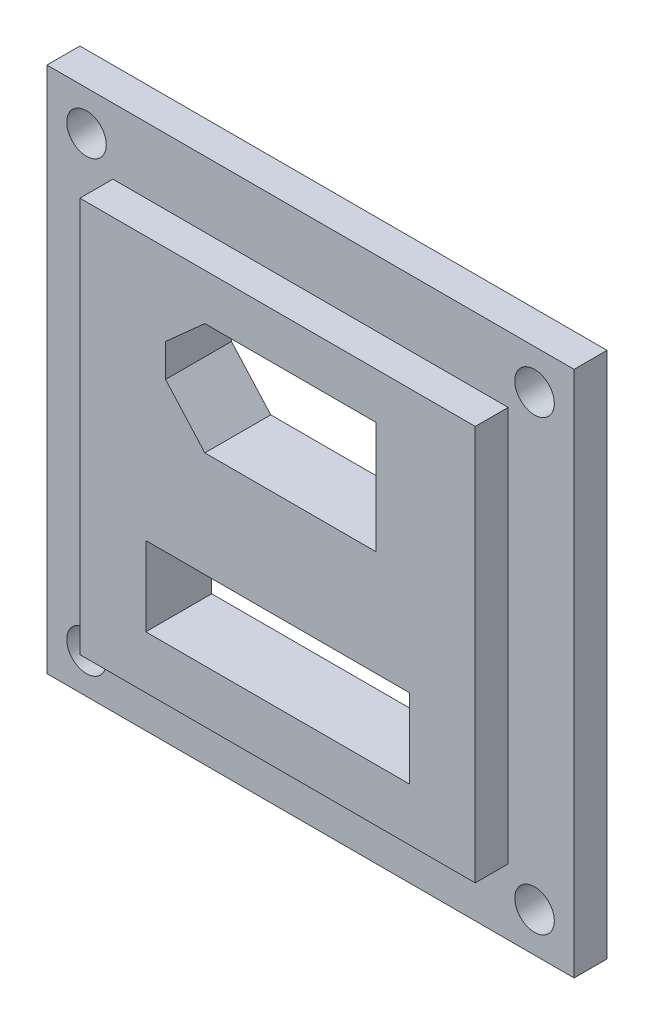
ISO-10303-21;
HEADER;
FILE_DESCRIPTION(('STEP AP214'),'2;1');
FILE_NAME('part.step','',(''),(''),'','','');
FILE_SCHEMA(('AUTOMOTIVE_DESIGN { 1 0 10303 214 1 1 1 1 }'));
ENDSEC;
DATA;
#1=APPLICATION_CONTEXT('core data for automotive mechanical design processes');
#2=APPLICATION_PROTOCOL_DEFINITION('international standard','automotive_design',2000,#1);
#3=PRODUCT_CONTEXT('',#1,'mechanical');
#4=PRODUCT('Part','Part','',(#3));
#5=PRODUCT_RELATED_PRODUCT_CATEGORY('part','',(#4));
#6=PRODUCT_DEFINITION_FORMATION('','',#4);
#7=PRODUCT_DEFINITION_CONTEXT('part definition',#1,'design');
#8=PRODUCT_DEFINITION('design','',#6,#7);
#9=PRODUCT_DEFINITION_SHAPE('','',#8);
#10=(LENGTH_UNIT() NAMED_UNIT(*) SI_UNIT(.MILLI.,.METRE.));
#11=(NAMED_UNIT(*) PLANE_ANGLE_UNIT() SI_UNIT($,.RADIAN.));
#12=(NAMED_UNIT(*) SI_UNIT($,.STERADIAN.) SOLID_ANGLE_UNIT());
#13=UNCERTAINTY_MEASURE_WITH_UNIT(LENGTH_MEASURE(1.E-05),#10,'distance_accuracy_value','');
#14=(GEOMETRIC_REPRESENTATION_CONTEXT(3) GLOBAL_UNCERTAINTY_ASSIGNED_CONTEXT((#13)) GLOBAL_UNIT_ASSIGNED_CONTEXT((#10,
#11,#12)) REPRESENTATION_CONTEXT('',''));
#15=CARTESIAN_POINT('',(0.,0.,0.));
#16=DIRECTION('',(0.,0.,1.));
#17=DIRECTION('',(1.,0.,0.));
#18=AXIS2_PLACEMENT_3D('',#15,#16,#17);
#19=CARTESIAN_POINT('',(0.,0.,2.5));
#20=DIRECTION('',(0.,0.,-1.));
#21=DIRECTION('',(-1.,0.,0.));
#22=AXIS2_PLACEMENT_3D('',#19,#20,#21);
#23=PLANE('',#22);
#24=CARTESIAN_POINT('',(3.,3.,2.5));
#25=DIRECTION('',(0.,0.,1.));
#26=DIRECTION('',(1.,0.,0.));
#27=AXIS2_PLACEMENT_3D('',#24,#25,#26);
#28=CIRCLE('',#27,1.5);
#29=CARTESIAN_POINT('',(4.5,3.,2.5));
#30=VERTEX_POINT('',#29);
#31=EDGE_CURVE('E208',#30,#30,#28,.T.);
#32=ORIENTED_EDGE('',*,*,#31,.F.);
#33=EDGE_LOOP('',(#32));
#34=FACE_BOUND('',#33,.T.);
#35=CARTESIAN_POINT('',(37.,3.,2.5));
#36=DIRECTION('',(0.,0.,1.));
#37=DIRECTION('',(1.,0.,0.));
#38=AXIS2_PLACEMENT_3D('',#35,#36,#37);
#39=CIRCLE('',#38,1.5);
#40=CARTESIAN_POINT('',(38.5,3.,2.5));
#41=VERTEX_POINT('',#40);
#42=EDGE_CURVE('E255',#41,#41,#39,.T.);
#43=ORIENTED_EDGE('',*,*,#42,.F.);
#44=EDGE_LOOP('',(#43));
#45=FACE_BOUND('',#44,.T.);
#46=CARTESIAN_POINT('',(37.,37.,2.5));
#47=DIRECTION('',(0.,0.,1.));
#48=DIRECTION('',(1.,0.,0.));
#49=AXIS2_PLACEMENT_3D('',#46,#47,#48);
#50=CIRCLE('',#49,1.5);
#51=CARTESIAN_POINT('',(38.5,37.,2.5));
#52=VERTEX_POINT('',#51);
#53=EDGE_CURVE('E249',#52,#52,#50,.T.);
#54=ORIENTED_EDGE('',*,*,#53,.F.);
#55=EDGE_LOOP('',(#54));
#56=FACE_BOUND('',#55,.T.);
#57=CARTESIAN_POINT('',(3.,37.,2.5));
#58=DIRECTION('',(0.,0.,1.));
#59=DIRECTION('',(1.,0.,0.));
#60=AXIS2_PLACEMENT_3D('',#57,#58,#59);
#61=CIRCLE('',#60,1.5);
#62=CARTESIAN_POINT('',(4.5,37.,2.5));
#63=VERTEX_POINT('',#62);
#64=EDGE_CURVE('E248',#63,#63,#61,.T.);
#65=ORIENTED_EDGE('',*,*,#64,.F.);
#66=EDGE_LOOP('',(#65));
#67=FACE_BOUND('',#66,.T.);
#68=DIRECTION('',(0.,-1.,0.));
#69=VECTOR('',#68,1.);
#70=CARTESIAN_POINT('',(0.,0.,2.5));
#71=LINE('',#70,#69);
#72=CARTESIAN_POINT('',(0.,40.,2.5));
#73=VERTEX_POINT('',#72);
#74=CARTESIAN_POINT('',(0.,0.,2.5));
#75=VERTEX_POINT('',#74);
#76=EDGE_CURVE('E302',#73,#75,#71,.T.);
#77=ORIENTED_EDGE('',*,*,#76,.T.);
#78=DIRECTION('',(1.,0.,0.));
#79=VECTOR('',#78,1.);
#80=CARTESIAN_POINT('',(0.,0.,2.5));
#81=LINE('',#80,#79);
#82=CARTESIAN_POINT('',(40.,0.,2.5));
#83=VERTEX_POINT('',#82);
#84=EDGE_CURVE('E305',#75,#83,#81,.T.);
#85=ORIENTED_EDGE('',*,*,#84,.T.);
#86=DIRECTION('',(0.,1.,0.));
#87=VECTOR('',#86,1.);
#88=CARTESIAN_POINT('',(40.,0.,2.5));
#89=LINE('',#88,#87);
#90=CARTESIAN_POINT('',(40.,40.,2.5));
#91=VERTEX_POINT('',#90);
#92=EDGE_CURVE('E308',#83,#91,#89,.T.);
#93=ORIENTED_EDGE('',*,*,#92,.T.);
#94=DIRECTION('',(-1.,0.,0.));
#95=VECTOR('',#94,1.);
#96=CARTESIAN_POINT('',(0.,40.,2.5));
#97=LINE('',#96,#95);
#98=EDGE_CURVE('E310',#91,#73,#97,.T.);
#99=ORIENTED_EDGE('',*,*,#98,.T.);
#100=EDGE_LOOP('',(#77,#85,#93,#99));
#101=FACE_BOUND('',#100,.T.);
#102=DIRECTION('',(0.,-1.,0.));
#103=VECTOR('',#102,1.);
#104=CARTESIAN_POINT('',(5.,35.,2.5));
#105=LINE('',#104,#103);
#106=CARTESIAN_POINT('',(5.,35.,2.5));
#107=VERTEX_POINT('',#106);
#108=CARTESIAN_POINT('',(5.00000000000001,5.,2.5));
#109=VERTEX_POINT('',#108);
#110=EDGE_CURVE('E266',#107,#109,#105,.T.);
#111=ORIENTED_EDGE('',*,*,#110,.F.);
#112=DIRECTION('',(-1.,0.,0.));
#113=VECTOR('',#112,1.);
#114=CARTESIAN_POINT('',(5.,35.,2.5));
#115=LINE('',#114,#113);
#116=CARTESIAN_POINT('',(35.,35.,2.5));
#117=VERTEX_POINT('',#116);
#118=EDGE_CURVE('E273',#117,#107,#115,.T.);
#119=ORIENTED_EDGE('',*,*,#118,.F.);
#120=DIRECTION('',(0.,1.,0.));
#121=VECTOR('',#120,1.);
#122=CARTESIAN_POINT('',(35.,35.,2.5));
#123=LINE('',#122,#121);
#124=CARTESIAN_POINT('',(35.,5.,2.5));
#125=VERTEX_POINT('',#124);
#126=EDGE_CURVE('E285',#125,#117,#123,.T.);
#127=ORIENTED_EDGE('',*,*,#126,.F.);
#128=DIRECTION('',(1.,0.,0.));
#129=VECTOR('',#128,1.);
#130=CARTESIAN_POINT('',(5.00000000000001,5.,2.5));
#131=LINE('',#130,#129);
#132=EDGE_CURVE('E282',#109,#125,#131,.T.);
#133=ORIENTED_EDGE('',*,*,#132,.F.);
#134=EDGE_LOOP('',(#111,#119,#127,#133));
#135=FACE_BOUND('',#134,.T.);
#136=ADVANCED_FACE('F33',(#34,#45,#56,#67,#101,#135),#23,.F.);
#137=CARTESIAN_POINT('',(0.,0.,2.5));
#138=DIRECTION('',(1.,0.,0.));
#139=DIRECTION('',(0.,0.,-1.));
#140=AXIS2_PLACEMENT_3D('',#137,#138,#139);
#141=PLANE('',#140);
#142=DIRECTION('',(0.,-1.,0.));
#143=VECTOR('',#142,1.);
#144=CARTESIAN_POINT('',(0.,0.,0.));
#145=LINE('',#144,#143);
#146=CARTESIAN_POINT('',(0.,40.,0.));
#147=VERTEX_POINT('',#146);
#148=CARTESIAN_POINT('',(0.,0.,0.));
#149=VERTEX_POINT('',#148);
#150=EDGE_CURVE('E301',#147,#149,#145,.T.);
#151=ORIENTED_EDGE('',*,*,#150,.T.);
#152=DIRECTION('',(0.,0.,-1.));
#153=VECTOR('',#152,1.);
#154=CARTESIAN_POINT('',(0.,0.,2.5));
#155=LINE('',#154,#153);
#156=EDGE_CURVE('E11',#75,#149,#155,.T.);
#157=ORIENTED_EDGE('',*,*,#156,.F.);
#158=ORIENTED_EDGE('',*,*,#76,.F.);
#159=DIRECTION('',(0.,0.,-1.));
#160=VECTOR('',#159,1.);
#161=CARTESIAN_POINT('',(0.,40.,2.5));
#162=LINE('',#161,#160);
#163=EDGE_CURVE('E312',#73,#147,#162,.T.);
#164=ORIENTED_EDGE('',*,*,#163,.T.);
#165=EDGE_LOOP('',(#151,#157,#158,#164));
#166=FACE_BOUND('',#165,.T.);
#167=ADVANCED_FACE('F35',(#166),#141,.F.);
#168=CARTESIAN_POINT('',(0.,0.,2.5));
#169=DIRECTION('',(0.,1.,0.));
#170=DIRECTION('',(0.,0.,1.));
#171=AXIS2_PLACEMENT_3D('',#168,#169,#170);
#172=PLANE('',#171);
#173=DIRECTION('',(1.,0.,0.));
#174=VECTOR('',#173,1.);
#175=CARTESIAN_POINT('',(0.,0.,0.));
#176=LINE('',#175,#174);
#177=CARTESIAN_POINT('',(40.,0.,0.));
#178=VERTEX_POINT('',#177);
#179=EDGE_CURVE('E315',#149,#178,#176,.T.);
#180=ORIENTED_EDGE('',*,*,#179,.T.);
#181=DIRECTION('',(0.,0.,-1.));
#182=VECTOR('',#181,1.);
#183=CARTESIAN_POINT('',(40.,0.,2.5));
#184=LINE('',#183,#182);
#185=EDGE_CURVE('E41',#83,#178,#184,.T.);
#186=ORIENTED_EDGE('',*,*,#185,.F.);
#187=ORIENTED_EDGE('',*,*,#84,.F.);
#188=ORIENTED_EDGE('',*,*,#156,.T.);
#189=EDGE_LOOP('',(#180,#186,#187,#188));
#190=FACE_BOUND('',#189,.T.);
#191=ADVANCED_FACE('F344',(#190),#172,.F.);
#192=CARTESIAN_POINT('',(40.,0.,2.5));
#193=DIRECTION('',(-1.,0.,0.));
#194=DIRECTION('',(0.,0.,1.));
#195=AXIS2_PLACEMENT_3D('',#192,#193,#194);
#196=PLANE('',#195);
#197=DIRECTION('',(0.,1.,0.));
#198=VECTOR('',#197,1.);
#199=CARTESIAN_POINT('',(40.,0.,0.));
#200=LINE('',#199,#198);
#201=CARTESIAN_POINT('',(40.,40.,0.));
#202=VERTEX_POINT('',#201);
#203=EDGE_CURVE('E317',#178,#202,#200,.T.);
#204=ORIENTED_EDGE('',*,*,#203,.T.);
#205=DIRECTION('',(0.,0.,-1.));
#206=VECTOR('',#205,1.);
#207=CARTESIAN_POINT('',(40.,40.,2.5));
#208=LINE('',#207,#206);
#209=EDGE_CURVE('E322',#91,#202,#208,.T.);
#210=ORIENTED_EDGE('',*,*,#209,.F.);
#211=ORIENTED_EDGE('',*,*,#92,.F.);
#212=ORIENTED_EDGE('',*,*,#185,.T.);
#213=EDGE_LOOP('',(#204,#210,#211,#212));
#214=FACE_BOUND('',#213,.T.);
#215=ADVANCED_FACE('F329',(#214),#196,.F.);
#216=CARTESIAN_POINT('',(0.,40.,2.5));
#217=DIRECTION('',(0.,-1.,0.));
#218=DIRECTION('',(0.,0.,-1.));
#219=AXIS2_PLACEMENT_3D('',#216,#217,#218);
#220=PLANE('',#219);
#221=DIRECTION('',(-1.,0.,0.));
#222=VECTOR('',#221,1.);
#223=CARTESIAN_POINT('',(0.,40.,0.));
#224=LINE('',#223,#222);
#225=EDGE_CURVE('E306',#202,#147,#224,.T.);
#226=ORIENTED_EDGE('',*,*,#225,.T.);
#227=ORIENTED_EDGE('',*,*,#163,.F.);
#228=ORIENTED_EDGE('',*,*,#98,.F.);
#229=ORIENTED_EDGE('',*,*,#209,.T.);
#230=EDGE_LOOP('',(#226,#227,#228,#229));
#231=FACE_BOUND('',#230,.T.);
#232=ADVANCED_FACE('F337',(#231),#220,.F.);
#233=CARTESIAN_POINT('',(0.,0.,0.));
#234=DIRECTION('',(0.,0.,-1.));
#235=DIRECTION('',(-1.,0.,0.));
#236=AXIS2_PLACEMENT_3D('',#233,#234,#235);
#237=PLANE('',#236);
#238=DIRECTION('',(0.,1.,0.));
#239=VECTOR('',#238,1.);
#240=CARTESIAN_POINT('',(27.4814239699997,23.,0.));
#241=LINE('',#240,#239);
#242=CARTESIAN_POINT('',(27.4814239699997,23.,0.));
#243=VERTEX_POINT('',#242);
#244=CARTESIAN_POINT('',(27.4814239699997,31.5,0.));
#245=VERTEX_POINT('',#244);
#246=EDGE_CURVE('E162',#243,#245,#241,.T.);
#247=ORIENTED_EDGE('',*,*,#246,.T.);
#248=DIRECTION('',(-1.,0.,0.));
#249=VECTOR('',#248,1.);
#250=CARTESIAN_POINT('',(27.4814239699997,31.5,0.));
#251=LINE('',#250,#249);
#252=CARTESIAN_POINT('',(14.4814239699997,31.5,0.));
#253=VERTEX_POINT('',#252);
#254=EDGE_CURVE('E173',#245,#253,#251,.T.);
#255=ORIENTED_EDGE('',*,*,#254,.T.);
#256=DIRECTION('',(-0.74535599249993,-0.666666666666667,0.));
#257=VECTOR('',#256,1.);
#258=CARTESIAN_POINT('',(14.4814239699997,31.5,0.));
#259=LINE('',#258,#257);
#260=CARTESIAN_POINT('',(11.5,28.8333333333333,0.));
#261=VERTEX_POINT('',#260);
#262=EDGE_CURVE('E48',#253,#261,#259,.T.);
#263=ORIENTED_EDGE('',*,*,#262,.T.);
#264=DIRECTION('',(0.,-1.,0.));
#265=VECTOR('',#264,1.);
#266=CARTESIAN_POINT('',(11.5,28.8333333333333,0.));
#267=LINE('',#266,#265);
#268=CARTESIAN_POINT('',(11.5,26.3333333333333,0.));
#269=VERTEX_POINT('',#268);
#270=EDGE_CURVE('E188',#261,#269,#267,.T.);
#271=ORIENTED_EDGE('',*,*,#270,.T.);
#272=DIRECTION('',(0.666666666666666,-0.745355992499931,0.));
#273=VECTOR('',#272,1.);
#274=CARTESIAN_POINT('',(11.5,26.3333333333333,0.));
#275=LINE('',#274,#273);
#276=CARTESIAN_POINT('',(14.4814239699997,23.,0.));
#277=VERTEX_POINT('',#276);
#278=EDGE_CURVE('E191',#269,#277,#275,.T.);
#279=ORIENTED_EDGE('',*,*,#278,.T.);
#280=DIRECTION('',(1.,0.,0.));
#281=VECTOR('',#280,1.);
#282=CARTESIAN_POINT('',(14.4814239699997,23.,0.));
#283=LINE('',#282,#281);
#284=EDGE_CURVE('E170',#277,#243,#283,.T.);
#285=ORIENTED_EDGE('',*,*,#284,.T.);
#286=EDGE_LOOP('',(#247,#255,#263,#271,#279,#285));
#287=FACE_BOUND('',#286,.T.);
#288=DIRECTION('',(0.,-1.,0.));
#289=VECTOR('',#288,1.);
#290=CARTESIAN_POINT('',(10.,15.,0.));
#291=LINE('',#290,#289);
#292=CARTESIAN_POINT('',(10.,15.,0.));
#293=VERTEX_POINT('',#292);
#294=CARTESIAN_POINT('',(10.,9.,0.));
#295=VERTEX_POINT('',#294);
#296=EDGE_CURVE('E216',#293,#295,#291,.T.);
#297=ORIENTED_EDGE('',*,*,#296,.T.);
#298=DIRECTION('',(1.,0.,0.));
#299=VECTOR('',#298,1.);
#300=CARTESIAN_POINT('',(10.,9.,0.));
#301=LINE('',#300,#299);
#302=CARTESIAN_POINT('',(30.,9.,0.));
#303=VERTEX_POINT('',#302);
#304=EDGE_CURVE('E219',#295,#303,#301,.T.);
#305=ORIENTED_EDGE('',*,*,#304,.T.);
#306=DIRECTION('',(0.,1.,0.));
#307=VECTOR('',#306,1.);
#308=CARTESIAN_POINT('',(30.,15.,0.));
#309=LINE('',#308,#307);
#310=CARTESIAN_POINT('',(30.,15.,0.));
#311=VERTEX_POINT('',#310);
#312=EDGE_CURVE('E56',#303,#311,#309,.T.);
#313=ORIENTED_EDGE('',*,*,#312,.T.);
#314=DIRECTION('',(-1.,0.,0.));
#315=VECTOR('',#314,1.);
#316=CARTESIAN_POINT('',(10.,15.,0.));
#317=LINE('',#316,#315);
#318=EDGE_CURVE('E224',#311,#293,#317,.T.);
#319=ORIENTED_EDGE('',*,*,#318,.T.);
#320=EDGE_LOOP('',(#297,#305,#313,#319));
#321=FACE_BOUND('',#320,.T.);
#322=CARTESIAN_POINT('',(3.,3.,0.));
#323=DIRECTION('',(0.,0.,1.));
#324=DIRECTION('',(1.,0.,0.));
#325=AXIS2_PLACEMENT_3D('',#322,#323,#324);
#326=CIRCLE('',#325,1.5);
#327=CARTESIAN_POINT('',(4.5,3.,0.));
#328=VERTEX_POINT('',#327);
#329=EDGE_CURVE('E258',#328,#328,#326,.T.);
#330=ORIENTED_EDGE('',*,*,#329,.T.);
#331=EDGE_LOOP('',(#330));
#332=FACE_BOUND('',#331,.T.);
#333=CARTESIAN_POINT('',(37.,3.,0.));
#334=DIRECTION('',(0.,0.,1.));
#335=DIRECTION('',(1.,0.,0.));
#336=AXIS2_PLACEMENT_3D('',#333,#334,#335);
#337=CIRCLE('',#336,1.5);
#338=CARTESIAN_POINT('',(38.5,3.,0.));
#339=VERTEX_POINT('',#338);
#340=EDGE_CURVE('E252',#339,#339,#337,.T.);
#341=ORIENTED_EDGE('',*,*,#340,.T.);
#342=EDGE_LOOP('',(#341));
#343=FACE_BOUND('',#342,.T.);
#344=CARTESIAN_POINT('',(37.,37.,0.));
#345=DIRECTION('',(0.,0.,1.));
#346=DIRECTION('',(1.,0.,0.));
#347=AXIS2_PLACEMENT_3D('',#344,#345,#346);
#348=CIRCLE('',#347,1.5);
#349=CARTESIAN_POINT('',(38.5,37.,0.));
#350=VERTEX_POINT('',#349);
#351=EDGE_CURVE('E245',#350,#350,#348,.T.);
#352=ORIENTED_EDGE('',*,*,#351,.T.);
#353=EDGE_LOOP('',(#352));
#354=FACE_BOUND('',#353,.T.);
#355=CARTESIAN_POINT('',(3.,37.,0.));
#356=DIRECTION('',(0.,0.,1.));
#357=DIRECTION('',(1.,0.,0.));
#358=AXIS2_PLACEMENT_3D('',#355,#356,#357);
#359=CIRCLE('',#358,1.5);
#360=CARTESIAN_POINT('',(4.5,37.,0.));
#361=VERTEX_POINT('',#360);
#362=EDGE_CURVE('E263',#361,#361,#359,.T.);
#363=ORIENTED_EDGE('',*,*,#362,.T.);
#364=EDGE_LOOP('',(#363));
#365=FACE_BOUND('',#364,.T.);
#366=ORIENTED_EDGE('',*,*,#150,.F.);
#367=ORIENTED_EDGE('',*,*,#225,.F.);
#368=ORIENTED_EDGE('',*,*,#203,.F.);
#369=ORIENTED_EDGE('',*,*,#179,.F.);
#370=EDGE_LOOP('',(#366,#367,#368,#369));
#371=FACE_BOUND('',#370,.T.);
#372=ADVANCED_FACE('F177',(#287,#321,#332,#343,#354,#365,#371),#237,.T.);
#373=CARTESIAN_POINT('',(5.,35.,5.));
#374=DIRECTION('',(1.,0.,0.));
#375=DIRECTION('',(0.,1.,0.));
#376=AXIS2_PLACEMENT_3D('',#373,#374,#375);
#377=PLANE('',#376);
#378=ORIENTED_EDGE('',*,*,#110,.T.);
#379=DIRECTION('',(0.,0.,-1.));
#380=VECTOR('',#379,1.);
#381=CARTESIAN_POINT('',(5.00000000000001,5.,5.));
#382=LINE('',#381,#380);
#383=CARTESIAN_POINT('',(5.00000000000001,5.,5.));
#384=VERTEX_POINT('',#383);
#385=EDGE_CURVE('E298',#384,#109,#382,.T.);
#386=ORIENTED_EDGE('',*,*,#385,.F.);
#387=DIRECTION('',(0.,-1.,0.));
#388=VECTOR('',#387,1.);
#389=CARTESIAN_POINT('',(5.,35.,5.));
#390=LINE('',#389,#388);
#391=CARTESIAN_POINT('',(5.,35.,5.));
#392=VERTEX_POINT('',#391);
#393=EDGE_CURVE('E269',#392,#384,#390,.T.);
#394=ORIENTED_EDGE('',*,*,#393,.F.);
#395=DIRECTION('',(0.,0.,-1.));
#396=VECTOR('',#395,1.);
#397=CARTESIAN_POINT('',(5.,35.,5.));
#398=LINE('',#397,#396);
#399=EDGE_CURVE('E279',#392,#107,#398,.T.);
#400=ORIENTED_EDGE('',*,*,#399,.T.);
#401=EDGE_LOOP('',(#378,#386,#394,#400));
#402=FACE_BOUND('',#401,.T.);
#403=ADVANCED_FACE('F360',(#402),#377,.F.);
#404=CARTESIAN_POINT('',(5.00000000000001,5.,5.));
#405=DIRECTION('',(0.,1.,0.));
#406=DIRECTION('',(0.,0.,1.));
#407=AXIS2_PLACEMENT_3D('',#404,#405,#406);
#408=PLANE('',#407);
#409=ORIENTED_EDGE('',*,*,#132,.T.);
#410=DIRECTION('',(0.,0.,-1.));
#411=VECTOR('',#410,1.);
#412=CARTESIAN_POINT('',(35.,5.,5.));
#413=LINE('',#412,#411);
#414=CARTESIAN_POINT('',(35.,5.,5.));
#415=VERTEX_POINT('',#414);
#416=EDGE_CURVE('E295',#415,#125,#413,.T.);
#417=ORIENTED_EDGE('',*,*,#416,.F.);
#418=DIRECTION('',(1.,0.,0.));
#419=VECTOR('',#418,1.);
#420=CARTESIAN_POINT('',(5.00000000000001,5.,5.));
#421=LINE('',#420,#419);
#422=EDGE_CURVE('E272',#384,#415,#421,.T.);
#423=ORIENTED_EDGE('',*,*,#422,.F.);
#424=ORIENTED_EDGE('',*,*,#385,.T.);
#425=EDGE_LOOP('',(#409,#417,#423,#424));
#426=FACE_BOUND('',#425,.T.);
#427=ADVANCED_FACE('F381',(#426),#408,.F.);
#428=CARTESIAN_POINT('',(35.,35.,5.));
#429=DIRECTION('',(-1.,0.,0.));
#430=DIRECTION('',(0.,-1.,0.));
#431=AXIS2_PLACEMENT_3D('',#428,#429,#430);
#432=PLANE('',#431);
#433=ORIENTED_EDGE('',*,*,#126,.T.);
#434=DIRECTION('',(0.,0.,-1.));
#435=VECTOR('',#434,1.);
#436=CARTESIAN_POINT('',(35.,35.,5.));
#437=LINE('',#436,#435);
#438=CARTESIAN_POINT('',(35.,35.,5.));
#439=VERTEX_POINT('',#438);
#440=EDGE_CURVE('E292',#439,#117,#437,.T.);
#441=ORIENTED_EDGE('',*,*,#440,.F.);
#442=DIRECTION('',(0.,1.,0.));
#443=VECTOR('',#442,1.);
#444=CARTESIAN_POINT('',(35.,35.,5.));
#445=LINE('',#444,#443);
#446=EDGE_CURVE('E275',#415,#439,#445,.T.);
#447=ORIENTED_EDGE('',*,*,#446,.F.);
#448=ORIENTED_EDGE('',*,*,#416,.T.);
#449=EDGE_LOOP('',(#433,#441,#447,#448));
#450=FACE_BOUND('',#449,.T.);
#451=ADVANCED_FACE('F388',(#450),#432,.F.);
#452=CARTESIAN_POINT('',(5.,35.,5.));
#453=DIRECTION('',(0.,-1.,0.));
#454=DIRECTION('',(0.,0.,-1.));
#455=AXIS2_PLACEMENT_3D('',#452,#453,#454);
#456=PLANE('',#455);
#457=ORIENTED_EDGE('',*,*,#118,.T.);
#458=ORIENTED_EDGE('',*,*,#399,.F.);
#459=DIRECTION('',(-1.,0.,0.));
#460=VECTOR('',#459,1.);
#461=CARTESIAN_POINT('',(5.,35.,5.));
#462=LINE('',#461,#460);
#463=EDGE_CURVE('E277',#439,#392,#462,.T.);
#464=ORIENTED_EDGE('',*,*,#463,.F.);
#465=ORIENTED_EDGE('',*,*,#440,.T.);
#466=EDGE_LOOP('',(#457,#458,#464,#465));
#467=FACE_BOUND('',#466,.T.);
#468=ADVANCED_FACE('F395',(#467),#456,.F.);
#469=CARTESIAN_POINT('',(0.,0.,5.));
#470=DIRECTION('',(0.,0.,1.));
#471=DIRECTION('',(1.,0.,0.));
#472=AXIS2_PLACEMENT_3D('',#469,#470,#471);
#473=PLANE('',#472);
#474=DIRECTION('',(0.,1.,0.));
#475=VECTOR('',#474,1.);
#476=CARTESIAN_POINT('',(27.4814239699997,23.,5.));
#477=LINE('',#476,#475);
#478=CARTESIAN_POINT('',(27.4814239699997,23.,5.));
#479=VERTEX_POINT('',#478);
#480=CARTESIAN_POINT('',(27.4814239699997,31.5,5.));
#481=VERTEX_POINT('',#480);
#482=EDGE_CURVE('E165',#479,#481,#477,.T.);
#483=ORIENTED_EDGE('',*,*,#482,.F.);
#484=DIRECTION('',(1.,0.,0.));
#485=VECTOR('',#484,1.);
#486=CARTESIAN_POINT('',(14.4814239699997,23.,5.));
#487=LINE('',#486,#485);
#488=CARTESIAN_POINT('',(14.4814239699997,23.,5.));
#489=VERTEX_POINT('',#488);
#490=EDGE_CURVE('E181',#489,#479,#487,.T.);
#491=ORIENTED_EDGE('',*,*,#490,.F.);
#492=DIRECTION('',(0.666666666666666,-0.745355992499931,0.));
#493=VECTOR('',#492,1.);
#494=CARTESIAN_POINT('',(11.5,26.3333333333333,5.));
#495=LINE('',#494,#493);
#496=CARTESIAN_POINT('',(11.5,26.3333333333333,5.));
#497=VERTEX_POINT('',#496);
#498=EDGE_CURVE('E184',#497,#489,#495,.T.);
#499=ORIENTED_EDGE('',*,*,#498,.F.);
#500=DIRECTION('',(0.,-1.,0.));
#501=VECTOR('',#500,1.);
#502=CARTESIAN_POINT('',(11.5,28.8333333333333,5.));
#503=LINE('',#502,#501);
#504=CARTESIAN_POINT('',(11.5,28.8333333333333,5.));
#505=VERTEX_POINT('',#504);
#506=EDGE_CURVE('E201',#505,#497,#503,.T.);
#507=ORIENTED_EDGE('',*,*,#506,.F.);
#508=DIRECTION('',(-0.74535599249993,-0.666666666666667,0.));
#509=VECTOR('',#508,1.);
#510=CARTESIAN_POINT('',(14.4814239699997,31.5,5.));
#511=LINE('',#510,#509);
#512=CARTESIAN_POINT('',(14.4814239699997,31.5,5.));
#513=VERTEX_POINT('',#512);
#514=EDGE_CURVE('E198',#513,#505,#511,.T.);
#515=ORIENTED_EDGE('',*,*,#514,.F.);
#516=DIRECTION('',(-1.,0.,0.));
#517=VECTOR('',#516,1.);
#518=CARTESIAN_POINT('',(27.4814239699997,31.5,5.));
#519=LINE('',#518,#517);
#520=EDGE_CURVE('E195',#481,#513,#519,.T.);
#521=ORIENTED_EDGE('',*,*,#520,.F.);
#522=EDGE_LOOP('',(#483,#491,#499,#507,#515,#521));
#523=FACE_BOUND('',#522,.T.);
#524=DIRECTION('',(0.,-1.,0.));
#525=VECTOR('',#524,1.);
#526=CARTESIAN_POINT('',(10.,15.,5.));
#527=LINE('',#526,#525);
#528=CARTESIAN_POINT('',(10.,15.,5.));
#529=VERTEX_POINT('',#528);
#530=CARTESIAN_POINT('',(10.,9.,5.));
#531=VERTEX_POINT('',#530);
#532=EDGE_CURVE('E228',#529,#531,#527,.T.);
#533=ORIENTED_EDGE('',*,*,#532,.F.);
#534=DIRECTION('',(-1.,0.,0.));
#535=VECTOR('',#534,1.);
#536=CARTESIAN_POINT('',(10.,15.,5.));
#537=LINE('',#536,#535);
#538=CARTESIAN_POINT('',(30.,15.,5.));
#539=VERTEX_POINT('',#538);
#540=EDGE_CURVE('E220',#539,#529,#537,.T.);
#541=ORIENTED_EDGE('',*,*,#540,.F.);
#542=DIRECTION('',(0.,1.,0.));
#543=VECTOR('',#542,1.);
#544=CARTESIAN_POINT('',(30.,15.,5.));
#545=LINE('',#544,#543);
#546=CARTESIAN_POINT('',(30.,9.,5.));
#547=VERTEX_POINT('',#546);
#548=EDGE_CURVE('E233',#547,#539,#545,.T.);
#549=ORIENTED_EDGE('',*,*,#548,.F.);
#550=DIRECTION('',(1.,0.,0.));
#551=VECTOR('',#550,1.);
#552=CARTESIAN_POINT('',(10.,9.,5.));
#553=LINE('',#552,#551);
#554=EDGE_CURVE('E230',#531,#547,#553,.T.);
#555=ORIENTED_EDGE('',*,*,#554,.F.);
#556=EDGE_LOOP('',(#533,#541,#549,#555));
#557=FACE_BOUND('',#556,.T.);
#558=ORIENTED_EDGE('',*,*,#393,.T.);
#559=ORIENTED_EDGE('',*,*,#422,.T.);
#560=ORIENTED_EDGE('',*,*,#446,.T.);
#561=ORIENTED_EDGE('',*,*,#463,.T.);
#562=EDGE_LOOP('',(#558,#559,#560,#561));
#563=FACE_BOUND('',#562,.T.);
#564=ADVANCED_FACE('F403',(#523,#557,#563),#473,.T.);
#565=CARTESIAN_POINT('',(3.,37.,0.));
#566=DIRECTION('',(0.,0.,1.));
#567=DIRECTION('',(1.,0.,0.));
#568=AXIS2_PLACEMENT_3D('',#565,#566,#567);
#569=CYLINDRICAL_SURFACE('',#568,1.5);
#570=ORIENTED_EDGE('',*,*,#362,.F.);
#571=EDGE_LOOP('',(#570));
#572=FACE_BOUND('',#571,.T.);
#573=ORIENTED_EDGE('',*,*,#64,.T.);
#574=EDGE_LOOP('',(#573));
#575=FACE_BOUND('',#574,.T.);
#576=ADVANCED_FACE('F410',(#572,#575),#569,.F.);
#577=CARTESIAN_POINT('',(37.,37.,0.));
#578=DIRECTION('',(0.,0.,1.));
#579=DIRECTION('',(1.,0.,0.));
#580=AXIS2_PLACEMENT_3D('',#577,#578,#579);
#581=CYLINDRICAL_SURFACE('',#580,1.5);
#582=ORIENTED_EDGE('',*,*,#351,.F.);
#583=EDGE_LOOP('',(#582));
#584=FACE_BOUND('',#583,.T.);
#585=ORIENTED_EDGE('',*,*,#53,.T.);
#586=EDGE_LOOP('',(#585));
#587=FACE_BOUND('',#586,.T.);
#588=ADVANCED_FACE('F419',(#584,#587),#581,.F.);
#589=CARTESIAN_POINT('',(37.,3.,0.));
#590=DIRECTION('',(0.,0.,1.));
#591=DIRECTION('',(1.,0.,0.));
#592=AXIS2_PLACEMENT_3D('',#589,#590,#591);
#593=CYLINDRICAL_SURFACE('',#592,1.5);
#594=ORIENTED_EDGE('',*,*,#340,.F.);
#595=EDGE_LOOP('',(#594));
#596=FACE_BOUND('',#595,.T.);
#597=ORIENTED_EDGE('',*,*,#42,.T.);
#598=EDGE_LOOP('',(#597));
#599=FACE_BOUND('',#598,.T.);
#600=ADVANCED_FACE('F427',(#596,#599),#593,.F.);
#601=CARTESIAN_POINT('',(3.,3.,0.));
#602=DIRECTION('',(0.,0.,1.));
#603=DIRECTION('',(1.,0.,0.));
#604=AXIS2_PLACEMENT_3D('',#601,#602,#603);
#605=CYLINDRICAL_SURFACE('',#604,1.5);
#606=ORIENTED_EDGE('',*,*,#329,.F.);
#607=EDGE_LOOP('',(#606));
#608=FACE_BOUND('',#607,.T.);
#609=ORIENTED_EDGE('',*,*,#31,.T.);
#610=EDGE_LOOP('',(#609));
#611=FACE_BOUND('',#610,.T.);
#612=ADVANCED_FACE('F435',(#608,#611),#605,.F.);
#613=CARTESIAN_POINT('',(10.,15.,0.));
#614=DIRECTION('',(-1.,0.,0.));
#615=DIRECTION('',(0.,0.,1.));
#616=AXIS2_PLACEMENT_3D('',#613,#614,#615);
#617=PLANE('',#616);
#618=ORIENTED_EDGE('',*,*,#532,.T.);
#619=DIRECTION('',(0.,0.,1.));
#620=VECTOR('',#619,1.);
#621=CARTESIAN_POINT('',(10.,9.,0.));
#622=LINE('',#621,#620);
#623=EDGE_CURVE('E227',#295,#531,#622,.T.);
#624=ORIENTED_EDGE('',*,*,#623,.F.);
#625=ORIENTED_EDGE('',*,*,#296,.F.);
#626=DIRECTION('',(0.,0.,1.));
#627=VECTOR('',#626,1.);
#628=CARTESIAN_POINT('',(10.,15.,0.));
#629=LINE('',#628,#627);
#630=EDGE_CURVE('E196',#293,#529,#629,.T.);
#631=ORIENTED_EDGE('',*,*,#630,.T.);
#632=EDGE_LOOP('',(#618,#624,#625,#631));
#633=FACE_BOUND('',#632,.T.);
#634=ADVANCED_FACE('F442',(#633),#617,.F.);
#635=CARTESIAN_POINT('',(10.,15.,0.));
#636=DIRECTION('',(0.,1.,0.));
#637=DIRECTION('',(0.,0.,1.));
#638=AXIS2_PLACEMENT_3D('',#635,#636,#637);
#639=PLANE('',#638);
#640=ORIENTED_EDGE('',*,*,#540,.T.);
#641=ORIENTED_EDGE('',*,*,#630,.F.);
#642=ORIENTED_EDGE('',*,*,#318,.F.);
#643=DIRECTION('',(0.,0.,1.));
#644=VECTOR('',#643,1.);
#645=CARTESIAN_POINT('',(30.,15.,0.));
#646=LINE('',#645,#644);
#647=EDGE_CURVE('E239',#311,#539,#646,.T.);
#648=ORIENTED_EDGE('',*,*,#647,.T.);
#649=EDGE_LOOP('',(#640,#641,#642,#648));
#650=FACE_BOUND('',#649,.T.);
#651=ADVANCED_FACE('F449',(#650),#639,.F.);
#652=CARTESIAN_POINT('',(30.,15.,0.));
#653=DIRECTION('',(1.,0.,0.));
#654=DIRECTION('',(0.,0.,-1.));
#655=AXIS2_PLACEMENT_3D('',#652,#653,#654);
#656=PLANE('',#655);
#657=ORIENTED_EDGE('',*,*,#548,.T.);
#658=ORIENTED_EDGE('',*,*,#647,.F.);
#659=ORIENTED_EDGE('',*,*,#312,.F.);
#660=DIRECTION('',(0.,0.,1.));
#661=VECTOR('',#660,1.);
#662=CARTESIAN_POINT('',(30.,9.,0.));
#663=LINE('',#662,#661);
#664=EDGE_CURVE('E241',#303,#547,#663,.T.);
#665=ORIENTED_EDGE('',*,*,#664,.T.);
#666=EDGE_LOOP('',(#657,#658,#659,#665));
#667=FACE_BOUND('',#666,.T.);
#668=ADVANCED_FACE('F457',(#667),#656,.F.);
#669=CARTESIAN_POINT('',(10.,9.,0.));
#670=DIRECTION('',(0.,-1.,0.));
#671=DIRECTION('',(0.,0.,-1.));
#672=AXIS2_PLACEMENT_3D('',#669,#670,#671);
#673=PLANE('',#672);
#674=ORIENTED_EDGE('',*,*,#554,.T.);
#675=ORIENTED_EDGE('',*,*,#664,.F.);
#676=ORIENTED_EDGE('',*,*,#304,.F.);
#677=ORIENTED_EDGE('',*,*,#623,.T.);
#678=EDGE_LOOP('',(#674,#675,#676,#677));
#679=FACE_BOUND('',#678,.T.);
#680=ADVANCED_FACE('F465',(#679),#673,.F.);
#681=CARTESIAN_POINT('',(27.4814239699997,23.,0.));
#682=DIRECTION('',(1.,0.,0.));
#683=DIRECTION('',(0.,0.,-1.));
#684=AXIS2_PLACEMENT_3D('',#681,#682,#683);
#685=PLANE('',#684);
#686=ORIENTED_EDGE('',*,*,#482,.T.);
#687=DIRECTION('',(0.,0.,1.));
#688=VECTOR('',#687,1.);
#689=CARTESIAN_POINT('',(27.4814239699997,31.5,0.));
#690=LINE('',#689,#688);
#691=EDGE_CURVE('E158',#245,#481,#690,.T.);
#692=ORIENTED_EDGE('',*,*,#691,.F.);
#693=ORIENTED_EDGE('',*,*,#246,.F.);
#694=DIRECTION('',(0.,0.,1.));
#695=VECTOR('',#694,1.);
#696=CARTESIAN_POINT('',(27.4814239699997,23.,0.));
#697=LINE('',#696,#695);
#698=EDGE_CURVE('E206',#243,#479,#697,.T.);
#699=ORIENTED_EDGE('',*,*,#698,.T.);
#700=EDGE_LOOP('',(#686,#692,#693,#699));
#701=FACE_BOUND('',#700,.T.);
#702=ADVANCED_FACE('F160',(#701),#685,.F.);
#703=CARTESIAN_POINT('',(14.4814239699997,23.,0.));
#704=DIRECTION('',(0.,-1.,0.));
#705=DIRECTION('',(0.,0.,-1.));
#706=AXIS2_PLACEMENT_3D('',#703,#704,#705);
#707=PLANE('',#706);
#708=ORIENTED_EDGE('',*,*,#490,.T.);
#709=ORIENTED_EDGE('',*,*,#698,.F.);
#710=ORIENTED_EDGE('',*,*,#284,.F.);
#711=DIRECTION('',(0.,0.,1.));
#712=VECTOR('',#711,1.);
#713=CARTESIAN_POINT('',(14.4814239699997,23.,0.));
#714=LINE('',#713,#712);
#715=EDGE_CURVE('E209',#277,#489,#714,.T.);
#716=ORIENTED_EDGE('',*,*,#715,.T.);
#717=EDGE_LOOP('',(#708,#709,#710,#716));
#718=FACE_BOUND('',#717,.T.);
#719=ADVANCED_FACE('F479',(#718),#707,.F.);
#720=CARTESIAN_POINT('',(11.5,26.3333333333333,0.));
#721=DIRECTION('',(-0.745355992499931,-0.666666666666666,0.));
#722=DIRECTION('',(0.666666666666666,-0.745355992499931,0.));
#723=AXIS2_PLACEMENT_3D('',#720,#721,#722);
#724=PLANE('',#723);
#725=ORIENTED_EDGE('',*,*,#498,.T.);
#726=ORIENTED_EDGE('',*,*,#715,.F.);
#727=ORIENTED_EDGE('',*,*,#278,.F.);
#728=DIRECTION('',(0.,0.,1.));
#729=VECTOR('',#728,1.);
#730=CARTESIAN_POINT('',(11.5,26.3333333333333,0.));
#731=LINE('',#730,#729);
#732=EDGE_CURVE('E211',#269,#497,#731,.T.);
#733=ORIENTED_EDGE('',*,*,#732,.T.);
#734=EDGE_LOOP('',(#725,#726,#727,#733));
#735=FACE_BOUND('',#734,.T.);
#736=ADVANCED_FACE('F486',(#735),#724,.F.);
#737=CARTESIAN_POINT('',(11.5,28.8333333333333,0.));
#738=DIRECTION('',(-1.,0.,0.));
#739=DIRECTION('',(0.,-1.,0.));
#740=AXIS2_PLACEMENT_3D('',#737,#738,#739);
#741=PLANE('',#740);
#742=ORIENTED_EDGE('',*,*,#506,.T.);
#743=ORIENTED_EDGE('',*,*,#732,.F.);
#744=ORIENTED_EDGE('',*,*,#270,.F.);
#745=DIRECTION('',(0.,0.,1.));
#746=VECTOR('',#745,1.);
#747=CARTESIAN_POINT('',(11.5,28.8333333333333,0.));
#748=LINE('',#747,#746);
#749=EDGE_CURVE('E213',#261,#505,#748,.T.);
#750=ORIENTED_EDGE('',*,*,#749,.T.);
#751=EDGE_LOOP('',(#742,#743,#744,#750));
#752=FACE_BOUND('',#751,.T.);
#753=ADVANCED_FACE('F494',(#752),#741,.F.);
#754=CARTESIAN_POINT('',(14.4814239699997,31.5,0.));
#755=DIRECTION('',(-0.666666666666667,0.74535599249993,0.));
#756=DIRECTION('',(-0.74535599249993,-0.666666666666667,0.));
#757=AXIS2_PLACEMENT_3D('',#754,#755,#756);
#758=PLANE('',#757);
#759=ORIENTED_EDGE('',*,*,#514,.T.);
#760=ORIENTED_EDGE('',*,*,#749,.F.);
#761=ORIENTED_EDGE('',*,*,#262,.F.);
#762=DIRECTION('',(0.,0.,1.));
#763=VECTOR('',#762,1.);
#764=CARTESIAN_POINT('',(14.4814239699997,31.5,0.));
#765=LINE('',#764,#763);
#766=EDGE_CURVE('E169',#253,#513,#765,.T.);
#767=ORIENTED_EDGE('',*,*,#766,.T.);
#768=EDGE_LOOP('',(#759,#760,#761,#767));
#769=FACE_BOUND('',#768,.T.);
#770=ADVANCED_FACE('F502',(#769),#758,.F.);
#771=CARTESIAN_POINT('',(27.4814239699997,31.5,0.));
#772=DIRECTION('',(0.,1.,0.));
#773=DIRECTION('',(0.,0.,1.));
#774=AXIS2_PLACEMENT_3D('',#771,#772,#773);
#775=PLANE('',#774);
#776=ORIENTED_EDGE('',*,*,#520,.T.);
#777=ORIENTED_EDGE('',*,*,#766,.F.);
#778=ORIENTED_EDGE('',*,*,#254,.F.);
#779=ORIENTED_EDGE('',*,*,#691,.T.);
#780=EDGE_LOOP('',(#776,#777,#778,#779));
#781=FACE_BOUND('',#780,.T.);
#782=ADVANCED_FACE('F174',(#781),#775,.F.);
#783=CLOSED_SHELL('',(#136,#167,#191,#215,#232,#372,#403,#427,#451,#468,#564,#576,#588,#600,
#612,#634,#651,#668,#680,#702,#719,#736,#753,#770,#782));
#784=MANIFOLD_SOLID_BREP('B2',#783);
#785=ADVANCED_BREP_SHAPE_REPRESENTATION('',(#18,#784),#14);
#786=SHAPE_DEFINITION_REPRESENTATION(#9,#785);
ENDSEC;
END-ISO-10303-21;
